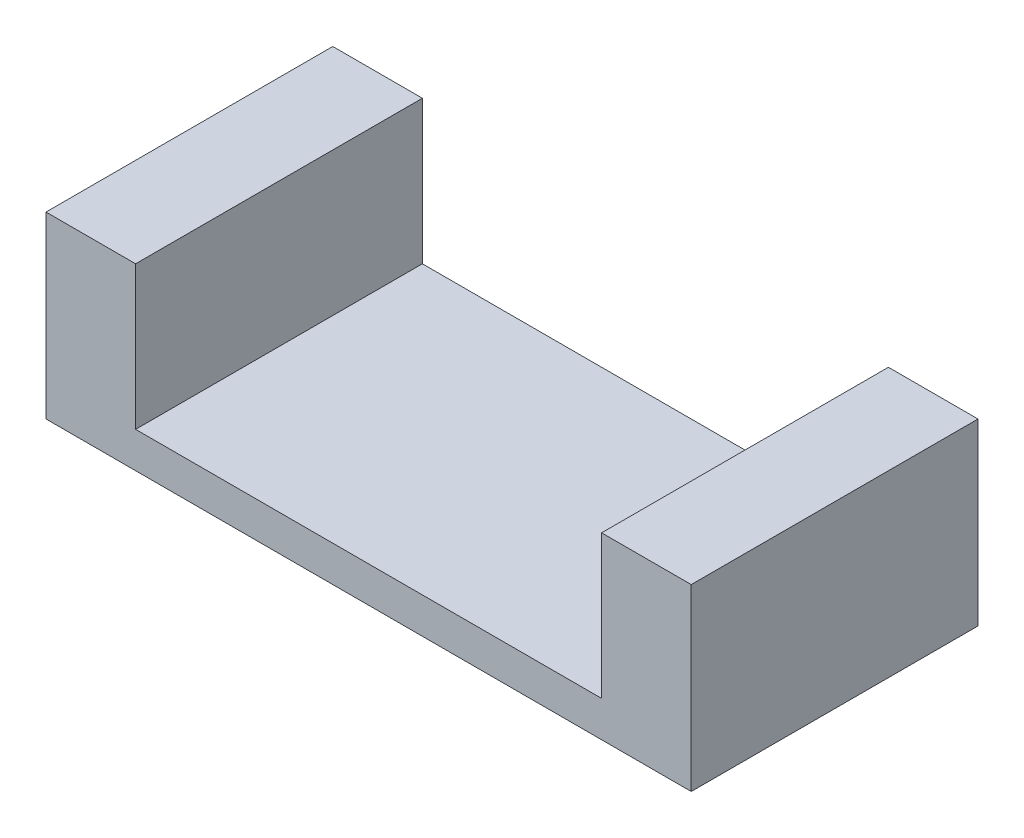
ISO-10303-21;
HEADER;
FILE_DESCRIPTION(('STEP AP214'),'2;1');
FILE_NAME('part.step','',(''),(''),'','','');
FILE_SCHEMA(('AUTOMOTIVE_DESIGN { 1 0 10303 214 1 1 1 1 }'));
ENDSEC;
DATA;
#1=APPLICATION_CONTEXT('core data for automotive mechanical design processes');
#2=APPLICATION_PROTOCOL_DEFINITION('international standard','automotive_design',2000,#1);
#3=PRODUCT_CONTEXT('',#1,'mechanical');
#4=PRODUCT('Part','Part','',(#3));
#5=PRODUCT_RELATED_PRODUCT_CATEGORY('part','',(#4));
#6=PRODUCT_DEFINITION_FORMATION('','',#4);
#7=PRODUCT_DEFINITION_CONTEXT('part definition',#1,'design');
#8=PRODUCT_DEFINITION('design','',#6,#7);
#9=PRODUCT_DEFINITION_SHAPE('','',#8);
#10=(LENGTH_UNIT() NAMED_UNIT(*) SI_UNIT(.MILLI.,.METRE.));
#11=(NAMED_UNIT(*) PLANE_ANGLE_UNIT() SI_UNIT($,.RADIAN.));
#12=(NAMED_UNIT(*) SI_UNIT($,.STERADIAN.) SOLID_ANGLE_UNIT());
#13=UNCERTAINTY_MEASURE_WITH_UNIT(LENGTH_MEASURE(1.E-05),#10,'distance_accuracy_value','');
#14=(GEOMETRIC_REPRESENTATION_CONTEXT(3) GLOBAL_UNCERTAINTY_ASSIGNED_CONTEXT((#13)) GLOBAL_UNIT_ASSIGNED_CONTEXT((#10,
#11,#12)) REPRESENTATION_CONTEXT('',''));
#15=CARTESIAN_POINT('',(0.,0.,0.));
#16=DIRECTION('',(0.,0.,1.));
#17=DIRECTION('',(1.,0.,0.));
#18=AXIS2_PLACEMENT_3D('',#15,#16,#17);
#19=CARTESIAN_POINT('',(0.,0.,1.6));
#20=DIRECTION('',(-1.,0.,0.));
#21=DIRECTION('',(0.,0.,1.));
#22=AXIS2_PLACEMENT_3D('',#19,#20,#21);
#23=PLANE('',#22);
#24=DIRECTION('',(0.,1.,0.));
#25=VECTOR('',#24,1.);
#26=CARTESIAN_POINT('',(0.,0.,0.));
#27=LINE('',#26,#25);
#28=CARTESIAN_POINT('',(0.,0.,0.));
#29=VERTEX_POINT('',#28);
#30=CARTESIAN_POINT('',(0.,1.,0.));
#31=VERTEX_POINT('',#30);
#32=EDGE_CURVE('E129',#29,#31,#27,.T.);
#33=ORIENTED_EDGE('',*,*,#32,.T.);
#34=DIRECTION('',(0.,0.,-1.));
#35=VECTOR('',#34,1.);
#36=CARTESIAN_POINT('',(0.,1.,1.6));
#37=LINE('',#36,#35);
#38=CARTESIAN_POINT('',(0.,1.,1.6));
#39=VERTEX_POINT('',#38);
#40=EDGE_CURVE('E11',#39,#31,#37,.T.);
#41=ORIENTED_EDGE('',*,*,#40,.F.);
#42=DIRECTION('',(0.,1.,0.));
#43=VECTOR('',#42,1.);
#44=CARTESIAN_POINT('',(0.,0.,1.6));
#45=LINE('',#44,#43);
#46=CARTESIAN_POINT('',(0.,0.,1.6));
#47=VERTEX_POINT('',#46);
#48=EDGE_CURVE('E143',#47,#39,#45,.T.);
#49=ORIENTED_EDGE('',*,*,#48,.F.);
#50=DIRECTION('',(0.,0.,-1.));
#51=VECTOR('',#50,1.);
#52=CARTESIAN_POINT('',(0.,0.,1.6));
#53=LINE('',#52,#51);
#54=EDGE_CURVE('E125',#47,#29,#53,.T.);
#55=ORIENTED_EDGE('',*,*,#54,.T.);
#56=EDGE_LOOP('',(#33,#41,#49,#55));
#57=FACE_BOUND('',#56,.T.);
#58=ADVANCED_FACE('F33',(#57),#23,.F.);
#59=CARTESIAN_POINT('',(0.,1.,1.6));
#60=DIRECTION('',(0.,-1.,0.));
#61=DIRECTION('',(0.,0.,-1.));
#62=AXIS2_PLACEMENT_3D('',#59,#60,#61);
#63=PLANE('',#62);
#64=DIRECTION('',(-1.,0.,0.));
#65=VECTOR('',#64,1.);
#66=CARTESIAN_POINT('',(0.,1.,0.));
#67=LINE('',#66,#65);
#68=CARTESIAN_POINT('',(-0.5,1.,0.));
#69=VERTEX_POINT('',#68);
#70=EDGE_CURVE('E132',#31,#69,#67,.T.);
#71=ORIENTED_EDGE('',*,*,#70,.T.);
#72=DIRECTION('',(0.,0.,-1.));
#73=VECTOR('',#72,1.);
#74=CARTESIAN_POINT('',(-0.5,1.,1.6));
#75=LINE('',#74,#73);
#76=CARTESIAN_POINT('',(-0.5,1.,1.6));
#77=VERTEX_POINT('',#76);
#78=EDGE_CURVE('E41',#77,#69,#75,.T.);
#79=ORIENTED_EDGE('',*,*,#78,.F.);
#80=DIRECTION('',(-1.,0.,0.));
#81=VECTOR('',#80,1.);
#82=CARTESIAN_POINT('',(0.,1.,1.6));
#83=LINE('',#82,#81);
#84=EDGE_CURVE('E92',#39,#77,#83,.T.);
#85=ORIENTED_EDGE('',*,*,#84,.F.);
#86=ORIENTED_EDGE('',*,*,#40,.T.);
#87=EDGE_LOOP('',(#71,#79,#85,#86));
#88=FACE_BOUND('',#87,.T.);
#89=ADVANCED_FACE('F178',(#88),#63,.F.);
#90=CARTESIAN_POINT('',(-0.5,1.,1.6));
#91=DIRECTION('',(1.,0.,0.));
#92=DIRECTION('',(0.,1.,0.));
#93=AXIS2_PLACEMENT_3D('',#90,#91,#92);
#94=PLANE('',#93);
#95=DIRECTION('',(0.,-1.,0.));
#96=VECTOR('',#95,1.);
#97=CARTESIAN_POINT('',(-0.5,1.,0.));
#98=LINE('',#97,#96);
#99=CARTESIAN_POINT('',(-0.5,0.2,0.));
#100=VERTEX_POINT('',#99);
#101=EDGE_CURVE('E134',#69,#100,#98,.T.);
#102=ORIENTED_EDGE('',*,*,#101,.T.);
#103=DIRECTION('',(0.,0.,-1.));
#104=VECTOR('',#103,1.);
#105=CARTESIAN_POINT('',(-0.5,0.2,1.6));
#106=LINE('',#105,#104);
#107=CARTESIAN_POINT('',(-0.5,0.2,1.6));
#108=VERTEX_POINT('',#107);
#109=EDGE_CURVE('E150',#108,#100,#106,.T.);
#110=ORIENTED_EDGE('',*,*,#109,.F.);
#111=DIRECTION('',(0.,-1.,0.));
#112=VECTOR('',#111,1.);
#113=CARTESIAN_POINT('',(-0.5,1.,1.6));
#114=LINE('',#113,#112);
#115=EDGE_CURVE('E158',#77,#108,#114,.T.);
#116=ORIENTED_EDGE('',*,*,#115,.F.);
#117=ORIENTED_EDGE('',*,*,#78,.T.);
#118=EDGE_LOOP('',(#102,#110,#116,#117));
#119=FACE_BOUND('',#118,.T.);
#120=ADVANCED_FACE('F156',(#119),#94,.F.);
#121=CARTESIAN_POINT('',(-0.5,0.2,1.6));
#122=DIRECTION('',(0.,-1.,0.));
#123=DIRECTION('',(1.,0.,0.));
#124=AXIS2_PLACEMENT_3D('',#121,#122,#123);
#125=PLANE('',#124);
#126=DIRECTION('',(-1.,0.,0.));
#127=VECTOR('',#126,1.);
#128=CARTESIAN_POINT('',(-0.5,0.2,0.));
#129=LINE('',#128,#127);
#130=CARTESIAN_POINT('',(-3.1,0.2,0.));
#131=VERTEX_POINT('',#130);
#132=EDGE_CURVE('E136',#100,#131,#129,.T.);
#133=ORIENTED_EDGE('',*,*,#132,.T.);
#134=DIRECTION('',(0.,0.,-1.));
#135=VECTOR('',#134,1.);
#136=CARTESIAN_POINT('',(-3.1,0.2,1.6));
#137=LINE('',#136,#135);
#138=CARTESIAN_POINT('',(-3.1,0.2,1.6));
#139=VERTEX_POINT('',#138);
#140=EDGE_CURVE('E147',#139,#131,#137,.T.);
#141=ORIENTED_EDGE('',*,*,#140,.F.);
#142=DIRECTION('',(-1.,0.,0.));
#143=VECTOR('',#142,1.);
#144=CARTESIAN_POINT('',(-0.5,0.2,1.6));
#145=LINE('',#144,#143);
#146=EDGE_CURVE('E170',#108,#139,#145,.T.);
#147=ORIENTED_EDGE('',*,*,#146,.F.);
#148=ORIENTED_EDGE('',*,*,#109,.T.);
#149=EDGE_LOOP('',(#133,#141,#147,#148));
#150=FACE_BOUND('',#149,.T.);
#151=ADVANCED_FACE('F166',(#150),#125,.F.);
#152=CARTESIAN_POINT('',(-3.1,0.999999999999999,1.6));
#153=DIRECTION('',(-1.,0.,0.));
#154=DIRECTION('',(0.,0.,1.));
#155=AXIS2_PLACEMENT_3D('',#152,#153,#154);
#156=PLANE('',#155);
#157=DIRECTION('',(0.,1.,0.));
#158=VECTOR('',#157,1.);
#159=CARTESIAN_POINT('',(-3.1,0.999999999999999,0.));
#160=LINE('',#159,#158);
#161=CARTESIAN_POINT('',(-3.1,0.999999999999999,0.));
#162=VERTEX_POINT('',#161);
#163=EDGE_CURVE('E138',#131,#162,#160,.T.);
#164=ORIENTED_EDGE('',*,*,#163,.T.);
#165=DIRECTION('',(0.,0.,-1.));
#166=VECTOR('',#165,1.);
#167=CARTESIAN_POINT('',(-3.1,0.999999999999999,1.6));
#168=LINE('',#167,#166);
#169=CARTESIAN_POINT('',(-3.1,0.999999999999999,1.6));
#170=VERTEX_POINT('',#169);
#171=EDGE_CURVE('E120',#170,#162,#168,.T.);
#172=ORIENTED_EDGE('',*,*,#171,.F.);
#173=DIRECTION('',(0.,1.,0.));
#174=VECTOR('',#173,1.);
#175=CARTESIAN_POINT('',(-3.1,0.999999999999999,1.6));
#176=LINE('',#175,#174);
#177=EDGE_CURVE('E111',#139,#170,#176,.T.);
#178=ORIENTED_EDGE('',*,*,#177,.F.);
#179=ORIENTED_EDGE('',*,*,#140,.T.);
#180=EDGE_LOOP('',(#164,#172,#178,#179));
#181=FACE_BOUND('',#180,.T.);
#182=ADVANCED_FACE('F169',(#181),#156,.F.);
#183=CARTESIAN_POINT('',(-3.6,1.,1.6));
#184=DIRECTION('',(0.,-1.,0.));
#185=DIRECTION('',(1.,0.,0.));
#186=AXIS2_PLACEMENT_3D('',#183,#184,#185);
#187=PLANE('',#186);
#188=DIRECTION('',(-1.,0.,0.));
#189=VECTOR('',#188,1.);
#190=CARTESIAN_POINT('',(-3.6,1.,0.));
#191=LINE('',#190,#189);
#192=CARTESIAN_POINT('',(-3.6,1.,0.));
#193=VERTEX_POINT('',#192);
#194=EDGE_CURVE('E119',#162,#193,#191,.T.);
#195=ORIENTED_EDGE('',*,*,#194,.T.);
#196=DIRECTION('',(0.,0.,-1.));
#197=VECTOR('',#196,1.);
#198=CARTESIAN_POINT('',(-3.6,1.,1.6));
#199=LINE('',#198,#197);
#200=CARTESIAN_POINT('',(-3.6,1.,1.6));
#201=VERTEX_POINT('',#200);
#202=EDGE_CURVE('E116',#201,#193,#199,.T.);
#203=ORIENTED_EDGE('',*,*,#202,.F.);
#204=DIRECTION('',(-1.,0.,0.));
#205=VECTOR('',#204,1.);
#206=CARTESIAN_POINT('',(-3.6,1.,1.6));
#207=LINE('',#206,#205);
#208=EDGE_CURVE('E105',#170,#201,#207,.T.);
#209=ORIENTED_EDGE('',*,*,#208,.F.);
#210=ORIENTED_EDGE('',*,*,#171,.T.);
#211=EDGE_LOOP('',(#195,#203,#209,#210));
#212=FACE_BOUND('',#211,.T.);
#213=ADVANCED_FACE('F117',(#212),#187,.F.);
#214=CARTESIAN_POINT('',(-3.6,0.,1.6));
#215=DIRECTION('',(1.,0.,0.));
#216=DIRECTION('',(0.,0.,-1.));
#217=AXIS2_PLACEMENT_3D('',#214,#215,#216);
#218=PLANE('',#217);
#219=DIRECTION('',(0.,-1.,0.));
#220=VECTOR('',#219,1.);
#221=CARTESIAN_POINT('',(-3.6,0.,0.));
#222=LINE('',#221,#220);
#223=CARTESIAN_POINT('',(-3.6,0.,0.));
#224=VERTEX_POINT('',#223);
#225=EDGE_CURVE('E78',#193,#224,#222,.T.);
#226=ORIENTED_EDGE('',*,*,#225,.T.);
#227=DIRECTION('',(0.,0.,-1.));
#228=VECTOR('',#227,1.);
#229=CARTESIAN_POINT('',(-3.6,0.,1.6));
#230=LINE('',#229,#228);
#231=CARTESIAN_POINT('',(-3.6,0.,1.6));
#232=VERTEX_POINT('',#231);
#233=EDGE_CURVE('E121',#232,#224,#230,.T.);
#234=ORIENTED_EDGE('',*,*,#233,.F.);
#235=DIRECTION('',(0.,-1.,0.));
#236=VECTOR('',#235,1.);
#237=CARTESIAN_POINT('',(-3.6,0.,1.6));
#238=LINE('',#237,#236);
#239=EDGE_CURVE('E109',#201,#232,#238,.T.);
#240=ORIENTED_EDGE('',*,*,#239,.F.);
#241=ORIENTED_EDGE('',*,*,#202,.T.);
#242=EDGE_LOOP('',(#226,#234,#240,#241));
#243=FACE_BOUND('',#242,.T.);
#244=ADVANCED_FACE('F123',(#243),#218,.F.);
#245=CARTESIAN_POINT('',(0.,0.,1.6));
#246=DIRECTION('',(0.,1.,0.));
#247=DIRECTION('',(-1.,0.,0.));
#248=AXIS2_PLACEMENT_3D('',#245,#246,#247);
#249=PLANE('',#248);
#250=DIRECTION('',(1.,0.,0.));
#251=VECTOR('',#250,1.);
#252=CARTESIAN_POINT('',(0.,0.,0.));
#253=LINE('',#252,#251);
#254=EDGE_CURVE('E84',#224,#29,#253,.T.);
#255=ORIENTED_EDGE('',*,*,#254,.T.);
#256=ORIENTED_EDGE('',*,*,#54,.F.);
#257=DIRECTION('',(1.,0.,0.));
#258=VECTOR('',#257,1.);
#259=CARTESIAN_POINT('',(0.,0.,1.6));
#260=LINE('',#259,#258);
#261=EDGE_CURVE('E49',#232,#47,#260,.T.);
#262=ORIENTED_EDGE('',*,*,#261,.F.);
#263=ORIENTED_EDGE('',*,*,#233,.T.);
#264=EDGE_LOOP('',(#255,#256,#262,#263));
#265=FACE_BOUND('',#264,.T.);
#266=ADVANCED_FACE('F194',(#265),#249,.F.);
#267=CARTESIAN_POINT('',(0.,0.,1.6));
#268=DIRECTION('',(0.,0.,1.));
#269=DIRECTION('',(1.,0.,0.));
#270=AXIS2_PLACEMENT_3D('',#267,#268,#269);
#271=PLANE('',#270);
#272=ORIENTED_EDGE('',*,*,#48,.T.);
#273=ORIENTED_EDGE('',*,*,#84,.T.);
#274=ORIENTED_EDGE('',*,*,#115,.T.);
#275=ORIENTED_EDGE('',*,*,#146,.T.);
#276=ORIENTED_EDGE('',*,*,#177,.T.);
#277=ORIENTED_EDGE('',*,*,#208,.T.);
#278=ORIENTED_EDGE('',*,*,#239,.T.);
#279=ORIENTED_EDGE('',*,*,#261,.T.);
#280=EDGE_LOOP('',(#272,#273,#274,#275,#276,#277,#278,#279));
#281=FACE_BOUND('',#280,.T.);
#282=ADVANCED_FACE('F107',(#281),#271,.T.);
#283=CARTESIAN_POINT('',(0.,0.,0.));
#284=DIRECTION('',(0.,0.,1.));
#285=DIRECTION('',(1.,0.,0.));
#286=AXIS2_PLACEMENT_3D('',#283,#284,#285);
#287=PLANE('',#286);
#288=ORIENTED_EDGE('',*,*,#32,.F.);
#289=ORIENTED_EDGE('',*,*,#254,.F.);
#290=ORIENTED_EDGE('',*,*,#225,.F.);
#291=ORIENTED_EDGE('',*,*,#194,.F.);
#292=ORIENTED_EDGE('',*,*,#163,.F.);
#293=ORIENTED_EDGE('',*,*,#132,.F.);
#294=ORIENTED_EDGE('',*,*,#101,.F.);
#295=ORIENTED_EDGE('',*,*,#70,.F.);
#296=EDGE_LOOP('',(#288,#289,#290,#291,#292,#293,#294,#295));
#297=FACE_BOUND('',#296,.T.);
#298=ADVANCED_FACE('F162',(#297),#287,.F.);
#299=CLOSED_SHELL('',(#58,#89,#120,#151,#182,#213,#244,#266,#282,#298));
#300=MANIFOLD_SOLID_BREP('B2',#299);
#301=ADVANCED_BREP_SHAPE_REPRESENTATION('',(#18,#300),#14);
#302=SHAPE_DEFINITION_REPRESENTATION(#9,#301);
ENDSEC;
END-ISO-10303-21;
